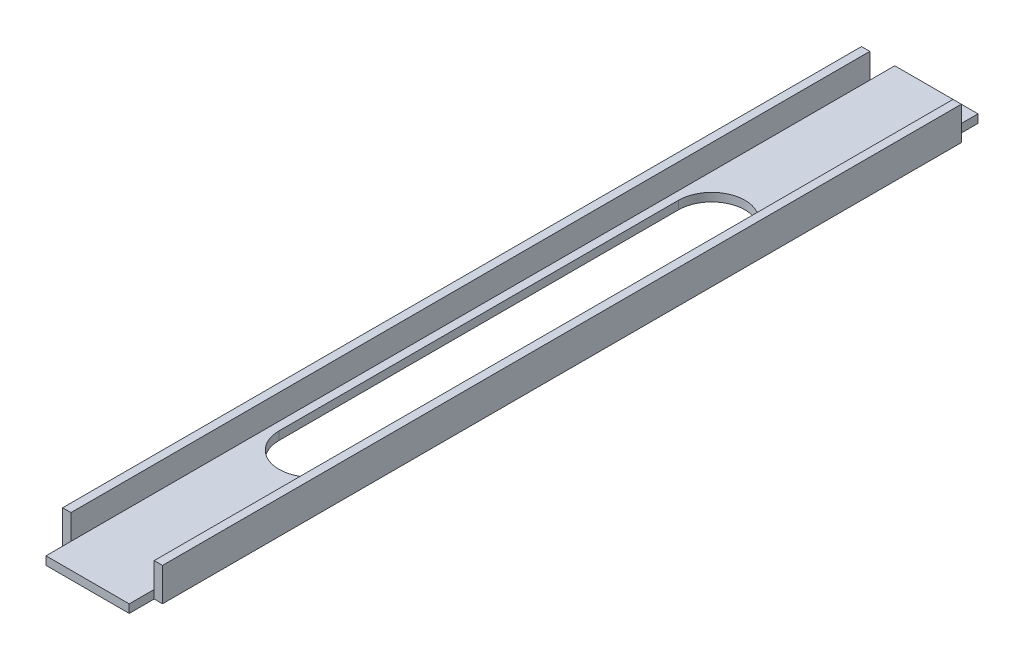
ISO-10303-21;
HEADER;
FILE_DESCRIPTION(('STEP AP214'),'2;1');
FILE_NAME('part.step','',(''),(''),'','','');
FILE_SCHEMA(('AUTOMOTIVE_DESIGN { 1 0 10303 214 1 1 1 1 }'));
ENDSEC;
DATA;
#1=APPLICATION_CONTEXT('core data for automotive mechanical design processes');
#2=APPLICATION_PROTOCOL_DEFINITION('international standard','automotive_design',2000,#1);
#3=PRODUCT_CONTEXT('',#1,'mechanical');
#4=PRODUCT('Part','Part','',(#3));
#5=PRODUCT_RELATED_PRODUCT_CATEGORY('part','',(#4));
#6=PRODUCT_DEFINITION_FORMATION('','',#4);
#7=PRODUCT_DEFINITION_CONTEXT('part definition',#1,'design');
#8=PRODUCT_DEFINITION('design','',#6,#7);
#9=PRODUCT_DEFINITION_SHAPE('','',#8);
#10=(LENGTH_UNIT() NAMED_UNIT(*) SI_UNIT(.MILLI.,.METRE.));
#11=(NAMED_UNIT(*) PLANE_ANGLE_UNIT() SI_UNIT($,.RADIAN.));
#12=(NAMED_UNIT(*) SI_UNIT($,.STERADIAN.) SOLID_ANGLE_UNIT());
#13=UNCERTAINTY_MEASURE_WITH_UNIT(LENGTH_MEASURE(1.E-05),#10,'distance_accuracy_value','');
#14=(GEOMETRIC_REPRESENTATION_CONTEXT(3) GLOBAL_UNCERTAINTY_ASSIGNED_CONTEXT((#13)) GLOBAL_UNIT_ASSIGNED_CONTEXT((#10,
#11,#12)) REPRESENTATION_CONTEXT('',''));
#15=CARTESIAN_POINT('',(0.,0.,0.));
#16=DIRECTION('',(0.,0.,1.));
#17=DIRECTION('',(1.,0.,0.));
#18=AXIS2_PLACEMENT_3D('',#15,#16,#17);
#19=CARTESIAN_POINT('',(0.,0.,323.85));
#20=DIRECTION('',(0.,0.,-1.));
#21=DIRECTION('',(-1.,0.,0.));
#22=AXIS2_PLACEMENT_3D('',#19,#20,#21);
#23=PLANE('',#22);
#24=DIRECTION('',(0.,1.,0.));
#25=VECTOR('',#24,1.);
#26=CARTESIAN_POINT('',(34.925,0.,323.85));
#27=LINE('',#26,#25);
#28=CARTESIAN_POINT('',(34.925,0.,323.85));
#29=VERTEX_POINT('',#28);
#30=CARTESIAN_POINT('',(34.925,3.175,323.85));
#31=VERTEX_POINT('',#30);
#32=EDGE_CURVE('E194',#29,#31,#27,.T.);
#33=ORIENTED_EDGE('',*,*,#32,.T.);
#34=DIRECTION('',(-1.,0.,0.));
#35=VECTOR('',#34,1.);
#36=CARTESIAN_POINT('',(3.175,3.175,323.85));
#37=LINE('',#36,#35);
#38=CARTESIAN_POINT('',(3.175,3.175,323.85));
#39=VERTEX_POINT('',#38);
#40=EDGE_CURVE('E264',#31,#39,#37,.T.);
#41=ORIENTED_EDGE('',*,*,#40,.T.);
#42=DIRECTION('',(0.,1.,0.));
#43=VECTOR('',#42,1.);
#44=CARTESIAN_POINT('',(3.175,0.,323.85));
#45=LINE('',#44,#43);
#46=CARTESIAN_POINT('',(3.175,0.,323.85));
#47=VERTEX_POINT('',#46);
#48=EDGE_CURVE('E229',#47,#39,#45,.T.);
#49=ORIENTED_EDGE('',*,*,#48,.F.);
#50=DIRECTION('',(1.,0.,0.));
#51=VECTOR('',#50,1.);
#52=CARTESIAN_POINT('',(0.,0.,323.85));
#53=LINE('',#52,#51);
#54=EDGE_CURVE('E261',#47,#29,#53,.T.);
#55=ORIENTED_EDGE('',*,*,#54,.T.);
#56=EDGE_LOOP('',(#33,#41,#49,#55));
#57=FACE_BOUND('',#56,.T.);
#58=ADVANCED_FACE('F33',(#57),#23,.F.);
#59=CARTESIAN_POINT('',(0.,0.,323.85));
#60=DIRECTION('',(0.,1.,0.));
#61=DIRECTION('',(0.,0.,1.));
#62=AXIS2_PLACEMENT_3D('',#59,#60,#61);
#63=PLANE('',#62);
#64=DIRECTION('',(0.,0.,-1.));
#65=VECTOR('',#64,1.);
#66=CARTESIAN_POINT('',(6.34999999999998,0.,238.125));
#67=LINE('',#66,#65);
#68=CARTESIAN_POINT('',(6.34999999999998,0.,238.125));
#69=VERTEX_POINT('',#68);
#70=CARTESIAN_POINT('',(6.35000000000002,0.,85.725));
#71=VERTEX_POINT('',#70);
#72=EDGE_CURVE('E179',#69,#71,#67,.T.);
#73=ORIENTED_EDGE('',*,*,#72,.F.);
#74=CARTESIAN_POINT('',(19.05,0.,238.125));
#75=DIRECTION('',(0.,-1.,0.));
#76=DIRECTION('',(0.,0.,-1.));
#77=AXIS2_PLACEMENT_3D('',#74,#75,#76);
#78=CIRCLE('',#77,12.7);
#79=CARTESIAN_POINT('',(31.75,0.,238.125));
#80=VERTEX_POINT('',#79);
#81=EDGE_CURVE('E48',#80,#69,#78,.T.);
#82=ORIENTED_EDGE('',*,*,#81,.F.);
#83=DIRECTION('',(0.,0.,1.));
#84=VECTOR('',#83,1.);
#85=CARTESIAN_POINT('',(31.75,0.,238.125));
#86=LINE('',#85,#84);
#87=CARTESIAN_POINT('',(31.75,0.,85.725));
#88=VERTEX_POINT('',#87);
#89=EDGE_CURVE('E165',#88,#80,#86,.T.);
#90=ORIENTED_EDGE('',*,*,#89,.F.);
#91=CARTESIAN_POINT('',(19.05,0.,85.725));
#92=DIRECTION('',(0.,-1.,0.));
#93=DIRECTION('',(0.,0.,-1.));
#94=AXIS2_PLACEMENT_3D('',#91,#92,#93);
#95=CIRCLE('',#94,12.7);
#96=EDGE_CURVE('E185',#71,#88,#95,.T.);
#97=ORIENTED_EDGE('',*,*,#96,.F.);
#98=EDGE_LOOP('',(#73,#82,#90,#97));
#99=FACE_BOUND('',#98,.T.);
#100=DIRECTION('',(1.,0.,0.));
#101=VECTOR('',#100,1.);
#102=CARTESIAN_POINT('',(34.925,0.,314.325));
#103=LINE('',#102,#101);
#104=CARTESIAN_POINT('',(34.925,0.,314.325));
#105=VERTEX_POINT('',#104);
#106=CARTESIAN_POINT('',(38.1,0.,314.325));
#107=VERTEX_POINT('',#106);
#108=EDGE_CURVE('E204',#105,#107,#103,.T.);
#109=ORIENTED_EDGE('',*,*,#108,.F.);
#110=DIRECTION('',(0.,0.,1.));
#111=VECTOR('',#110,1.);
#112=CARTESIAN_POINT('',(34.925,0.,323.85));
#113=LINE('',#112,#111);
#114=EDGE_CURVE('E197',#105,#29,#113,.T.);
#115=ORIENTED_EDGE('',*,*,#114,.T.);
#116=ORIENTED_EDGE('',*,*,#54,.F.);
#117=DIRECTION('',(0.,0.,1.));
#118=VECTOR('',#117,1.);
#119=CARTESIAN_POINT('',(3.175,0.,323.85));
#120=LINE('',#119,#118);
#121=CARTESIAN_POINT('',(3.175,0.,314.325));
#122=VERTEX_POINT('',#121);
#123=EDGE_CURVE('E236',#122,#47,#120,.T.);
#124=ORIENTED_EDGE('',*,*,#123,.F.);
#125=DIRECTION('',(-1.,0.,0.));
#126=VECTOR('',#125,1.);
#127=CARTESIAN_POINT('',(3.175,0.,314.325));
#128=LINE('',#127,#126);
#129=CARTESIAN_POINT('',(0.,0.,314.325));
#130=VERTEX_POINT('',#129);
#131=EDGE_CURVE('E241',#122,#130,#128,.T.);
#132=ORIENTED_EDGE('',*,*,#131,.T.);
#133=DIRECTION('',(0.,0.,-1.));
#134=VECTOR('',#133,1.);
#135=CARTESIAN_POINT('',(0.,0.,323.85));
#136=LINE('',#135,#134);
#137=CARTESIAN_POINT('',(0.,0.,9.52500000000001));
#138=VERTEX_POINT('',#137);
#139=EDGE_CURVE('E294',#130,#138,#136,.T.);
#140=ORIENTED_EDGE('',*,*,#139,.T.);
#141=DIRECTION('',(-1.,0.,0.));
#142=VECTOR('',#141,1.);
#143=CARTESIAN_POINT('',(3.175,0.,9.52500000000001));
#144=LINE('',#143,#142);
#145=CARTESIAN_POINT('',(3.175,0.,9.52500000000001));
#146=VERTEX_POINT('',#145);
#147=EDGE_CURVE('E253',#146,#138,#144,.T.);
#148=ORIENTED_EDGE('',*,*,#147,.F.);
#149=DIRECTION('',(0.,0.,1.));
#150=VECTOR('',#149,1.);
#151=CARTESIAN_POINT('',(3.175,0.,0.));
#152=LINE('',#151,#150);
#153=CARTESIAN_POINT('',(3.175,0.,0.));
#154=VERTEX_POINT('',#153);
#155=EDGE_CURVE('E246',#154,#146,#152,.T.);
#156=ORIENTED_EDGE('',*,*,#155,.F.);
#157=DIRECTION('',(1.,0.,0.));
#158=VECTOR('',#157,1.);
#159=CARTESIAN_POINT('',(0.,0.,0.));
#160=LINE('',#159,#158);
#161=CARTESIAN_POINT('',(34.925,0.,0.));
#162=VERTEX_POINT('',#161);
#163=EDGE_CURVE('E260',#154,#162,#160,.T.);
#164=ORIENTED_EDGE('',*,*,#163,.T.);
#165=DIRECTION('',(0.,0.,1.));
#166=VECTOR('',#165,1.);
#167=CARTESIAN_POINT('',(34.925,0.,0.));
#168=LINE('',#167,#166);
#169=CARTESIAN_POINT('',(34.925,0.,9.52500000000001));
#170=VERTEX_POINT('',#169);
#171=EDGE_CURVE('E216',#162,#170,#168,.T.);
#172=ORIENTED_EDGE('',*,*,#171,.T.);
#173=DIRECTION('',(1.,0.,0.));
#174=VECTOR('',#173,1.);
#175=CARTESIAN_POINT('',(34.925,0.,9.52500000000001));
#176=LINE('',#175,#174);
#177=CARTESIAN_POINT('',(38.1,0.,9.52500000000001));
#178=VERTEX_POINT('',#177);
#179=EDGE_CURVE('E207',#170,#178,#176,.T.);
#180=ORIENTED_EDGE('',*,*,#179,.T.);
#181=DIRECTION('',(0.,0.,-1.));
#182=VECTOR('',#181,1.);
#183=CARTESIAN_POINT('',(38.1,0.,323.85));
#184=LINE('',#183,#182);
#185=EDGE_CURVE('E291',#107,#178,#184,.T.);
#186=ORIENTED_EDGE('',*,*,#185,.F.);
#187=EDGE_LOOP('',(#109,#115,#116,#124,#132,#140,#148,#156,#164,#172,#180,#186));
#188=FACE_BOUND('',#187,.T.);
#189=ADVANCED_FACE('F306',(#99,#188),#63,.F.);
#190=CARTESIAN_POINT('',(38.1,0.,323.85));
#191=DIRECTION('',(-1.,0.,0.));
#192=DIRECTION('',(0.,0.,1.));
#193=AXIS2_PLACEMENT_3D('',#190,#191,#192);
#194=PLANE('',#193);
#195=DIRECTION('',(0.,-1.,0.));
#196=VECTOR('',#195,1.);
#197=CARTESIAN_POINT('',(38.1,0.,314.325));
#198=LINE('',#197,#196);
#199=CARTESIAN_POINT('',(38.1,12.7,314.325));
#200=VERTEX_POINT('',#199);
#201=EDGE_CURVE('E198',#200,#107,#198,.T.);
#202=ORIENTED_EDGE('',*,*,#201,.T.);
#203=ORIENTED_EDGE('',*,*,#185,.T.);
#204=DIRECTION('',(0.,1.,0.));
#205=VECTOR('',#204,1.);
#206=CARTESIAN_POINT('',(38.1,0.,9.52500000000001));
#207=LINE('',#206,#205);
#208=CARTESIAN_POINT('',(38.1,12.7,9.52500000000001));
#209=VERTEX_POINT('',#208);
#210=EDGE_CURVE('E171',#178,#209,#207,.T.);
#211=ORIENTED_EDGE('',*,*,#210,.T.);
#212=DIRECTION('',(0.,0.,-1.));
#213=VECTOR('',#212,1.);
#214=CARTESIAN_POINT('',(38.1,12.7,323.85));
#215=LINE('',#214,#213);
#216=EDGE_CURVE('E288',#200,#209,#215,.T.);
#217=ORIENTED_EDGE('',*,*,#216,.F.);
#218=EDGE_LOOP('',(#202,#203,#211,#217));
#219=FACE_BOUND('',#218,.T.);
#220=ADVANCED_FACE('F327',(#219),#194,.F.);
#221=CARTESIAN_POINT('',(38.1,12.7,323.85));
#222=DIRECTION('',(0.,-1.,0.));
#223=DIRECTION('',(0.,0.,-1.));
#224=AXIS2_PLACEMENT_3D('',#221,#222,#223);
#225=PLANE('',#224);
#226=DIRECTION('',(1.,0.,0.));
#227=VECTOR('',#226,1.);
#228=CARTESIAN_POINT('',(34.925,12.7,314.325));
#229=LINE('',#228,#227);
#230=CARTESIAN_POINT('',(34.925,12.7,314.325));
#231=VERTEX_POINT('',#230);
#232=EDGE_CURVE('E208',#231,#200,#229,.T.);
#233=ORIENTED_EDGE('',*,*,#232,.T.);
#234=ORIENTED_EDGE('',*,*,#216,.T.);
#235=DIRECTION('',(1.,0.,0.));
#236=VECTOR('',#235,1.);
#237=CARTESIAN_POINT('',(34.925,12.7,9.52500000000001));
#238=LINE('',#237,#236);
#239=CARTESIAN_POINT('',(34.925,12.7,9.52500000000001));
#240=VERTEX_POINT('',#239);
#241=EDGE_CURVE('E220',#240,#209,#238,.T.);
#242=ORIENTED_EDGE('',*,*,#241,.F.);
#243=DIRECTION('',(0.,0.,-1.));
#244=VECTOR('',#243,1.);
#245=CARTESIAN_POINT('',(34.925,12.7,323.85));
#246=LINE('',#245,#244);
#247=EDGE_CURVE('E285',#231,#240,#246,.T.);
#248=ORIENTED_EDGE('',*,*,#247,.F.);
#249=EDGE_LOOP('',(#233,#234,#242,#248));
#250=FACE_BOUND('',#249,.T.);
#251=ADVANCED_FACE('F324',(#250),#225,.F.);
#252=CARTESIAN_POINT('',(34.925,3.175,323.85));
#253=DIRECTION('',(1.,0.,0.));
#254=DIRECTION('',(0.,0.,-1.));
#255=AXIS2_PLACEMENT_3D('',#252,#253,#254);
#256=PLANE('',#255);
#257=DIRECTION('',(0.,-1.,0.));
#258=VECTOR('',#257,1.);
#259=CARTESIAN_POINT('',(34.925,0.,314.325));
#260=LINE('',#259,#258);
#261=CARTESIAN_POINT('',(34.925,3.175,314.325));
#262=VERTEX_POINT('',#261);
#263=EDGE_CURVE('E202',#231,#262,#260,.T.);
#264=ORIENTED_EDGE('',*,*,#263,.F.);
#265=ORIENTED_EDGE('',*,*,#247,.T.);
#266=DIRECTION('',(0.,1.,0.));
#267=VECTOR('',#266,1.);
#268=CARTESIAN_POINT('',(34.925,0.,9.52500000000001));
#269=LINE('',#268,#267);
#270=CARTESIAN_POINT('',(34.925,3.175,9.52500000000001));
#271=VERTEX_POINT('',#270);
#272=EDGE_CURVE('E217',#271,#240,#269,.T.);
#273=ORIENTED_EDGE('',*,*,#272,.F.);
#274=DIRECTION('',(0.,0.,-1.));
#275=VECTOR('',#274,1.);
#276=CARTESIAN_POINT('',(34.925,3.175,323.85));
#277=LINE('',#276,#275);
#278=EDGE_CURVE('E281',#262,#271,#277,.T.);
#279=ORIENTED_EDGE('',*,*,#278,.F.);
#280=EDGE_LOOP('',(#264,#265,#273,#279));
#281=FACE_BOUND('',#280,.T.);
#282=ADVANCED_FACE('F318',(#281),#256,.F.);
#283=CARTESIAN_POINT('',(0.,0.,323.85));
#284=DIRECTION('',(1.,0.,0.));
#285=DIRECTION('',(0.,0.,-1.));
#286=AXIS2_PLACEMENT_3D('',#283,#284,#285);
#287=PLANE('',#286);
#288=ORIENTED_EDGE('',*,*,#139,.F.);
#289=DIRECTION('',(0.,-1.,0.));
#290=VECTOR('',#289,1.);
#291=CARTESIAN_POINT('',(0.,0.,314.325));
#292=LINE('',#291,#290);
#293=CARTESIAN_POINT('',(0.,12.7,314.325));
#294=VERTEX_POINT('',#293);
#295=EDGE_CURVE('E232',#294,#130,#292,.T.);
#296=ORIENTED_EDGE('',*,*,#295,.F.);
#297=DIRECTION('',(0.,0.,-1.));
#298=VECTOR('',#297,1.);
#299=CARTESIAN_POINT('',(0.,12.7,323.85));
#300=LINE('',#299,#298);
#301=CARTESIAN_POINT('',(0.,12.7,9.52500000000001));
#302=VERTEX_POINT('',#301);
#303=EDGE_CURVE('E268',#294,#302,#300,.T.);
#304=ORIENTED_EDGE('',*,*,#303,.T.);
#305=DIRECTION('',(0.,1.,0.));
#306=VECTOR('',#305,1.);
#307=CARTESIAN_POINT('',(0.,0.,9.52500000000001));
#308=LINE('',#307,#306);
#309=EDGE_CURVE('E228',#138,#302,#308,.T.);
#310=ORIENTED_EDGE('',*,*,#309,.F.);
#311=EDGE_LOOP('',(#288,#296,#304,#310));
#312=FACE_BOUND('',#311,.T.);
#313=ADVANCED_FACE('F35',(#312),#287,.F.);
#314=CARTESIAN_POINT('',(3.175,3.175,323.85));
#315=DIRECTION('',(0.,-1.,0.));
#316=DIRECTION('',(0.,0.,-1.));
#317=AXIS2_PLACEMENT_3D('',#314,#315,#316);
#318=PLANE('',#317);
#319=DIRECTION('',(0.,0.,-1.));
#320=VECTOR('',#319,1.);
#321=CARTESIAN_POINT('',(31.75,3.175,238.125));
#322=LINE('',#321,#320);
#323=CARTESIAN_POINT('',(31.75,3.175,238.125));
#324=VERTEX_POINT('',#323);
#325=CARTESIAN_POINT('',(31.75,3.175,85.725));
#326=VERTEX_POINT('',#325);
#327=EDGE_CURVE('E177',#324,#326,#322,.T.);
#328=ORIENTED_EDGE('',*,*,#327,.F.);
#329=CARTESIAN_POINT('',(19.05,3.175,238.125));
#330=DIRECTION('',(0.,-1.,0.));
#331=DIRECTION('',(0.,0.,-1.));
#332=AXIS2_PLACEMENT_3D('',#329,#330,#331);
#333=CIRCLE('',#332,12.7);
#334=CARTESIAN_POINT('',(6.34999999999998,3.175,238.125));
#335=VERTEX_POINT('',#334);
#336=EDGE_CURVE('E159',#335,#324,#333,.F.);
#337=ORIENTED_EDGE('',*,*,#336,.F.);
#338=DIRECTION('',(0.,0.,1.));
#339=VECTOR('',#338,1.);
#340=CARTESIAN_POINT('',(6.34999999999998,3.175,238.125));
#341=LINE('',#340,#339);
#342=CARTESIAN_POINT('',(6.35000000000003,3.175,85.725));
#343=VERTEX_POINT('',#342);
#344=EDGE_CURVE('E168',#343,#335,#341,.T.);
#345=ORIENTED_EDGE('',*,*,#344,.F.);
#346=CARTESIAN_POINT('',(19.05,3.175,85.725));
#347=DIRECTION('',(0.,-1.,0.));
#348=DIRECTION('',(0.,0.,-1.));
#349=AXIS2_PLACEMENT_3D('',#346,#347,#348);
#350=CIRCLE('',#349,12.7);
#351=EDGE_CURVE('E56',#326,#343,#350,.F.);
#352=ORIENTED_EDGE('',*,*,#351,.F.);
#353=EDGE_LOOP('',(#328,#337,#345,#352));
#354=FACE_BOUND('',#353,.T.);
#355=DIRECTION('',(-1.,0.,0.));
#356=VECTOR('',#355,1.);
#357=CARTESIAN_POINT('',(3.175,3.175,0.));
#358=LINE('',#357,#356);
#359=CARTESIAN_POINT('',(34.925,3.175,0.));
#360=VERTEX_POINT('',#359);
#361=CARTESIAN_POINT('',(3.175,3.175,0.));
#362=VERTEX_POINT('',#361);
#363=EDGE_CURVE('E265',#360,#362,#358,.T.);
#364=ORIENTED_EDGE('',*,*,#363,.T.);
#365=DIRECTION('',(0.,0.,1.));
#366=VECTOR('',#365,1.);
#367=CARTESIAN_POINT('',(3.175,3.175,323.85));
#368=LINE('',#367,#366);
#369=CARTESIAN_POINT('',(3.175,3.175,9.52500000000001));
#370=VERTEX_POINT('',#369);
#371=EDGE_CURVE('E244',#362,#370,#368,.T.);
#372=ORIENTED_EDGE('',*,*,#371,.T.);
#373=DIRECTION('',(0.,0.,-1.));
#374=VECTOR('',#373,1.);
#375=CARTESIAN_POINT('',(3.175,3.175,323.85));
#376=LINE('',#375,#374);
#377=CARTESIAN_POINT('',(3.175,3.175,314.325));
#378=VERTEX_POINT('',#377);
#379=EDGE_CURVE('E278',#378,#370,#376,.T.);
#380=ORIENTED_EDGE('',*,*,#379,.F.);
#381=EDGE_CURVE('E279',#39,#378,#376,.T.);
#382=ORIENTED_EDGE('',*,*,#381,.F.);
#383=ORIENTED_EDGE('',*,*,#40,.F.);
#384=EDGE_CURVE('E282',#31,#262,#277,.T.);
#385=ORIENTED_EDGE('',*,*,#384,.T.);
#386=ORIENTED_EDGE('',*,*,#278,.T.);
#387=DIRECTION('',(0.,0.,-1.));
#388=VECTOR('',#387,1.);
#389=CARTESIAN_POINT('',(34.925,3.175,323.85));
#390=LINE('',#389,#388);
#391=EDGE_CURVE('E211',#271,#360,#390,.T.);
#392=ORIENTED_EDGE('',*,*,#391,.T.);
#393=EDGE_LOOP('',(#364,#372,#380,#382,#383,#385,#386,#392));
#394=FACE_BOUND('',#393,.T.);
#395=ADVANCED_FACE('F174',(#354,#394),#318,.F.);
#396=CARTESIAN_POINT('',(3.175,3.175,323.85));
#397=DIRECTION('',(-1.,0.,0.));
#398=DIRECTION('',(0.,0.,1.));
#399=AXIS2_PLACEMENT_3D('',#396,#397,#398);
#400=PLANE('',#399);
#401=DIRECTION('',(0.,0.,-1.));
#402=VECTOR('',#401,1.);
#403=CARTESIAN_POINT('',(3.175,12.7,323.85));
#404=LINE('',#403,#402);
#405=CARTESIAN_POINT('',(3.175,12.7,314.325));
#406=VERTEX_POINT('',#405);
#407=CARTESIAN_POINT('',(3.175,12.7,9.52500000000001));
#408=VERTEX_POINT('',#407);
#409=EDGE_CURVE('E275',#406,#408,#404,.T.);
#410=ORIENTED_EDGE('',*,*,#409,.F.);
#411=DIRECTION('',(0.,-1.,0.));
#412=VECTOR('',#411,1.);
#413=CARTESIAN_POINT('',(3.175,0.,314.325));
#414=LINE('',#413,#412);
#415=EDGE_CURVE('E233',#406,#378,#414,.T.);
#416=ORIENTED_EDGE('',*,*,#415,.T.);
#417=ORIENTED_EDGE('',*,*,#379,.T.);
#418=DIRECTION('',(0.,1.,0.));
#419=VECTOR('',#418,1.);
#420=CARTESIAN_POINT('',(3.175,0.,9.52500000000001));
#421=LINE('',#420,#419);
#422=EDGE_CURVE('E249',#370,#408,#421,.T.);
#423=ORIENTED_EDGE('',*,*,#422,.T.);
#424=EDGE_LOOP('',(#410,#416,#417,#423));
#425=FACE_BOUND('',#424,.T.);
#426=ADVANCED_FACE('F351',(#425),#400,.F.);
#427=CARTESIAN_POINT('',(0.,12.7,323.85));
#428=DIRECTION('',(0.,-1.,0.));
#429=DIRECTION('',(0.,0.,-1.));
#430=AXIS2_PLACEMENT_3D('',#427,#428,#429);
#431=PLANE('',#430);
#432=ORIENTED_EDGE('',*,*,#303,.F.);
#433=DIRECTION('',(-1.,0.,0.));
#434=VECTOR('',#433,1.);
#435=CARTESIAN_POINT('',(3.175,12.7,314.325));
#436=LINE('',#435,#434);
#437=EDGE_CURVE('E238',#406,#294,#436,.T.);
#438=ORIENTED_EDGE('',*,*,#437,.F.);
#439=ORIENTED_EDGE('',*,*,#409,.T.);
#440=DIRECTION('',(-1.,0.,0.));
#441=VECTOR('',#440,1.);
#442=CARTESIAN_POINT('',(3.175,12.7,9.52500000000001));
#443=LINE('',#442,#441);
#444=EDGE_CURVE('E240',#408,#302,#443,.T.);
#445=ORIENTED_EDGE('',*,*,#444,.T.);
#446=EDGE_LOOP('',(#432,#438,#439,#445));
#447=FACE_BOUND('',#446,.T.);
#448=ADVANCED_FACE('F355',(#447),#431,.F.);
#449=CARTESIAN_POINT('',(0.,0.,0.));
#450=DIRECTION('',(0.,0.,-1.));
#451=DIRECTION('',(-1.,0.,0.));
#452=AXIS2_PLACEMENT_3D('',#449,#450,#451);
#453=PLANE('',#452);
#454=DIRECTION('',(0.,1.,0.));
#455=VECTOR('',#454,1.);
#456=CARTESIAN_POINT('',(34.925,0.,0.));
#457=LINE('',#456,#455);
#458=EDGE_CURVE('E11',#162,#360,#457,.T.);
#459=ORIENTED_EDGE('',*,*,#458,.F.);
#460=ORIENTED_EDGE('',*,*,#163,.F.);
#461=DIRECTION('',(0.,-1.,0.));
#462=VECTOR('',#461,1.);
#463=CARTESIAN_POINT('',(3.175,0.,0.));
#464=LINE('',#463,#462);
#465=EDGE_CURVE('E41',#362,#154,#464,.T.);
#466=ORIENTED_EDGE('',*,*,#465,.F.);
#467=ORIENTED_EDGE('',*,*,#363,.F.);
#468=EDGE_LOOP('',(#459,#460,#466,#467));
#469=FACE_BOUND('',#468,.T.);
#470=ADVANCED_FACE('F308',(#469),#453,.T.);
#471=CARTESIAN_POINT('',(3.175,0.,0.));
#472=DIRECTION('',(1.,0.,0.));
#473=DIRECTION('',(0.,0.,-1.));
#474=AXIS2_PLACEMENT_3D('',#471,#472,#473);
#475=PLANE('',#474);
#476=ORIENTED_EDGE('',*,*,#465,.T.);
#477=ORIENTED_EDGE('',*,*,#155,.T.);
#478=EDGE_CURVE('E250',#146,#370,#421,.T.);
#479=ORIENTED_EDGE('',*,*,#478,.T.);
#480=ORIENTED_EDGE('',*,*,#371,.F.);
#481=EDGE_LOOP('',(#476,#477,#479,#480));
#482=FACE_BOUND('',#481,.T.);
#483=ADVANCED_FACE('F299',(#482),#475,.F.);
#484=CARTESIAN_POINT('',(3.175,0.,9.52500000000001));
#485=DIRECTION('',(0.,0.,1.));
#486=DIRECTION('',(1.,0.,0.));
#487=AXIS2_PLACEMENT_3D('',#484,#485,#486);
#488=PLANE('',#487);
#489=ORIENTED_EDGE('',*,*,#309,.T.);
#490=ORIENTED_EDGE('',*,*,#444,.F.);
#491=ORIENTED_EDGE('',*,*,#422,.F.);
#492=ORIENTED_EDGE('',*,*,#478,.F.);
#493=ORIENTED_EDGE('',*,*,#147,.T.);
#494=EDGE_LOOP('',(#489,#490,#491,#492,#493));
#495=FACE_BOUND('',#494,.T.);
#496=ADVANCED_FACE('F361',(#495),#488,.F.);
#497=CARTESIAN_POINT('',(3.175,0.,0.));
#498=DIRECTION('',(-1.,0.,0.));
#499=DIRECTION('',(0.,0.,1.));
#500=AXIS2_PLACEMENT_3D('',#497,#498,#499);
#501=PLANE('',#500);
#502=ORIENTED_EDGE('',*,*,#381,.T.);
#503=EDGE_CURVE('E231',#378,#122,#414,.T.);
#504=ORIENTED_EDGE('',*,*,#503,.T.);
#505=ORIENTED_EDGE('',*,*,#123,.T.);
#506=ORIENTED_EDGE('',*,*,#48,.T.);
#507=EDGE_LOOP('',(#502,#504,#505,#506));
#508=FACE_BOUND('',#507,.T.);
#509=ADVANCED_FACE('F343',(#508),#501,.T.);
#510=CARTESIAN_POINT('',(3.175,0.,314.325));
#511=DIRECTION('',(0.,0.,-1.));
#512=DIRECTION('',(-1.,0.,0.));
#513=AXIS2_PLACEMENT_3D('',#510,#511,#512);
#514=PLANE('',#513);
#515=ORIENTED_EDGE('',*,*,#295,.T.);
#516=ORIENTED_EDGE('',*,*,#131,.F.);
#517=ORIENTED_EDGE('',*,*,#503,.F.);
#518=ORIENTED_EDGE('',*,*,#415,.F.);
#519=ORIENTED_EDGE('',*,*,#437,.T.);
#520=EDGE_LOOP('',(#515,#516,#517,#518,#519));
#521=FACE_BOUND('',#520,.T.);
#522=ADVANCED_FACE('F346',(#521),#514,.F.);
#523=CARTESIAN_POINT('',(34.925,0.,0.));
#524=DIRECTION('',(-1.,0.,0.));
#525=DIRECTION('',(0.,0.,-1.));
#526=AXIS2_PLACEMENT_3D('',#523,#524,#525);
#527=PLANE('',#526);
#528=EDGE_CURVE('E213',#170,#271,#269,.T.);
#529=ORIENTED_EDGE('',*,*,#528,.F.);
#530=ORIENTED_EDGE('',*,*,#171,.F.);
#531=ORIENTED_EDGE('',*,*,#458,.T.);
#532=ORIENTED_EDGE('',*,*,#391,.F.);
#533=EDGE_LOOP('',(#529,#530,#531,#532));
#534=FACE_BOUND('',#533,.T.);
#535=ADVANCED_FACE('F311',(#534),#527,.F.);
#536=CARTESIAN_POINT('',(34.925,0.,9.52500000000001));
#537=DIRECTION('',(0.,0.,-1.));
#538=DIRECTION('',(-1.,0.,0.));
#539=AXIS2_PLACEMENT_3D('',#536,#537,#538);
#540=PLANE('',#539);
#541=ORIENTED_EDGE('',*,*,#210,.F.);
#542=ORIENTED_EDGE('',*,*,#179,.F.);
#543=ORIENTED_EDGE('',*,*,#528,.T.);
#544=ORIENTED_EDGE('',*,*,#272,.T.);
#545=ORIENTED_EDGE('',*,*,#241,.T.);
#546=EDGE_LOOP('',(#541,#542,#543,#544,#545));
#547=FACE_BOUND('',#546,.T.);
#548=ADVANCED_FACE('F322',(#547),#540,.T.);
#549=CARTESIAN_POINT('',(34.925,0.,0.));
#550=DIRECTION('',(1.,0.,0.));
#551=DIRECTION('',(0.,0.,1.));
#552=AXIS2_PLACEMENT_3D('',#549,#550,#551);
#553=PLANE('',#552);
#554=ORIENTED_EDGE('',*,*,#384,.F.);
#555=ORIENTED_EDGE('',*,*,#32,.F.);
#556=ORIENTED_EDGE('',*,*,#114,.F.);
#557=EDGE_CURVE('E201',#262,#105,#260,.T.);
#558=ORIENTED_EDGE('',*,*,#557,.F.);
#559=EDGE_LOOP('',(#554,#555,#556,#558));
#560=FACE_BOUND('',#559,.T.);
#561=ADVANCED_FACE('F335',(#560),#553,.T.);
#562=CARTESIAN_POINT('',(34.925,0.,314.325));
#563=DIRECTION('',(0.,0.,1.));
#564=DIRECTION('',(1.,0.,0.));
#565=AXIS2_PLACEMENT_3D('',#562,#563,#564);
#566=PLANE('',#565);
#567=ORIENTED_EDGE('',*,*,#201,.F.);
#568=ORIENTED_EDGE('',*,*,#232,.F.);
#569=ORIENTED_EDGE('',*,*,#263,.T.);
#570=ORIENTED_EDGE('',*,*,#557,.T.);
#571=ORIENTED_EDGE('',*,*,#108,.T.);
#572=EDGE_LOOP('',(#567,#568,#569,#570,#571));
#573=FACE_BOUND('',#572,.T.);
#574=ADVANCED_FACE('F332',(#573),#566,.T.);
#575=CARTESIAN_POINT('',(19.05,12.701,238.125));
#576=DIRECTION('',(0.,-1.,0.));
#577=DIRECTION('',(0.,0.,-1.));
#578=AXIS2_PLACEMENT_3D('',#575,#576,#577);
#579=CYLINDRICAL_SURFACE('',#578,12.7);
#580=ORIENTED_EDGE('',*,*,#336,.T.);
#581=DIRECTION('',(0.,-1.,0.));
#582=VECTOR('',#581,1.);
#583=CARTESIAN_POINT('',(31.75,12.701,238.125));
#584=LINE('',#583,#582);
#585=EDGE_CURVE('E172',#324,#80,#584,.T.);
#586=ORIENTED_EDGE('',*,*,#585,.T.);
#587=ORIENTED_EDGE('',*,*,#81,.T.);
#588=DIRECTION('',(0.,-1.,0.));
#589=VECTOR('',#588,1.);
#590=CARTESIAN_POINT('',(6.34999999999998,12.701,238.125));
#591=LINE('',#590,#589);
#592=EDGE_CURVE('E155',#335,#69,#591,.T.);
#593=ORIENTED_EDGE('',*,*,#592,.F.);
#594=EDGE_LOOP('',(#580,#586,#587,#593));
#595=FACE_BOUND('',#594,.T.);
#596=ADVANCED_FACE('F157',(#595),#579,.F.);
#597=CARTESIAN_POINT('',(31.75,12.701,238.125));
#598=DIRECTION('',(1.,0.,0.));
#599=DIRECTION('',(0.,0.,-1.));
#600=AXIS2_PLACEMENT_3D('',#597,#598,#599);
#601=PLANE('',#600);
#602=ORIENTED_EDGE('',*,*,#327,.T.);
#603=DIRECTION('',(0.,-1.,0.));
#604=VECTOR('',#603,1.);
#605=CARTESIAN_POINT('',(31.75,12.701,85.725));
#606=LINE('',#605,#604);
#607=EDGE_CURVE('E191',#326,#88,#606,.T.);
#608=ORIENTED_EDGE('',*,*,#607,.T.);
#609=ORIENTED_EDGE('',*,*,#89,.T.);
#610=ORIENTED_EDGE('',*,*,#585,.F.);
#611=EDGE_LOOP('',(#602,#608,#609,#610));
#612=FACE_BOUND('',#611,.T.);
#613=ADVANCED_FACE('F492',(#612),#601,.F.);
#614=CARTESIAN_POINT('',(19.05,12.701,85.725));
#615=DIRECTION('',(0.,-1.,0.));
#616=DIRECTION('',(0.,0.,-1.));
#617=AXIS2_PLACEMENT_3D('',#614,#615,#616);
#618=CYLINDRICAL_SURFACE('',#617,12.7);
#619=ORIENTED_EDGE('',*,*,#351,.T.);
#620=DIRECTION('',(0.,-1.,0.));
#621=VECTOR('',#620,1.);
#622=CARTESIAN_POINT('',(6.35000000000002,12.701,85.725));
#623=LINE('',#622,#621);
#624=EDGE_CURVE('E164',#343,#71,#623,.T.);
#625=ORIENTED_EDGE('',*,*,#624,.T.);
#626=ORIENTED_EDGE('',*,*,#96,.T.);
#627=ORIENTED_EDGE('',*,*,#607,.F.);
#628=EDGE_LOOP('',(#619,#625,#626,#627));
#629=FACE_BOUND('',#628,.T.);
#630=ADVANCED_FACE('F500',(#629),#618,.F.);
#631=CARTESIAN_POINT('',(6.34999999999998,12.701,238.125));
#632=DIRECTION('',(-1.,0.,0.));
#633=DIRECTION('',(0.,0.,1.));
#634=AXIS2_PLACEMENT_3D('',#631,#632,#633);
#635=PLANE('',#634);
#636=ORIENTED_EDGE('',*,*,#344,.T.);
#637=ORIENTED_EDGE('',*,*,#592,.T.);
#638=ORIENTED_EDGE('',*,*,#72,.T.);
#639=ORIENTED_EDGE('',*,*,#624,.F.);
#640=EDGE_LOOP('',(#636,#637,#638,#639));
#641=FACE_BOUND('',#640,.T.);
#642=ADVANCED_FACE('F169',(#641),#635,.F.);
#643=CLOSED_SHELL('',(#58,#189,#220,#251,#282,#313,#395,#426,#448,#470,#483,#496,#509,#522,#535,
#548,#561,#574,#596,#613,#630,#642));
#644=MANIFOLD_SOLID_BREP('B2',#643);
#645=ADVANCED_BREP_SHAPE_REPRESENTATION('',(#18,#644),#14);
#646=SHAPE_DEFINITION_REPRESENTATION(#9,#645);
ENDSEC;
END-ISO-10303-21;
